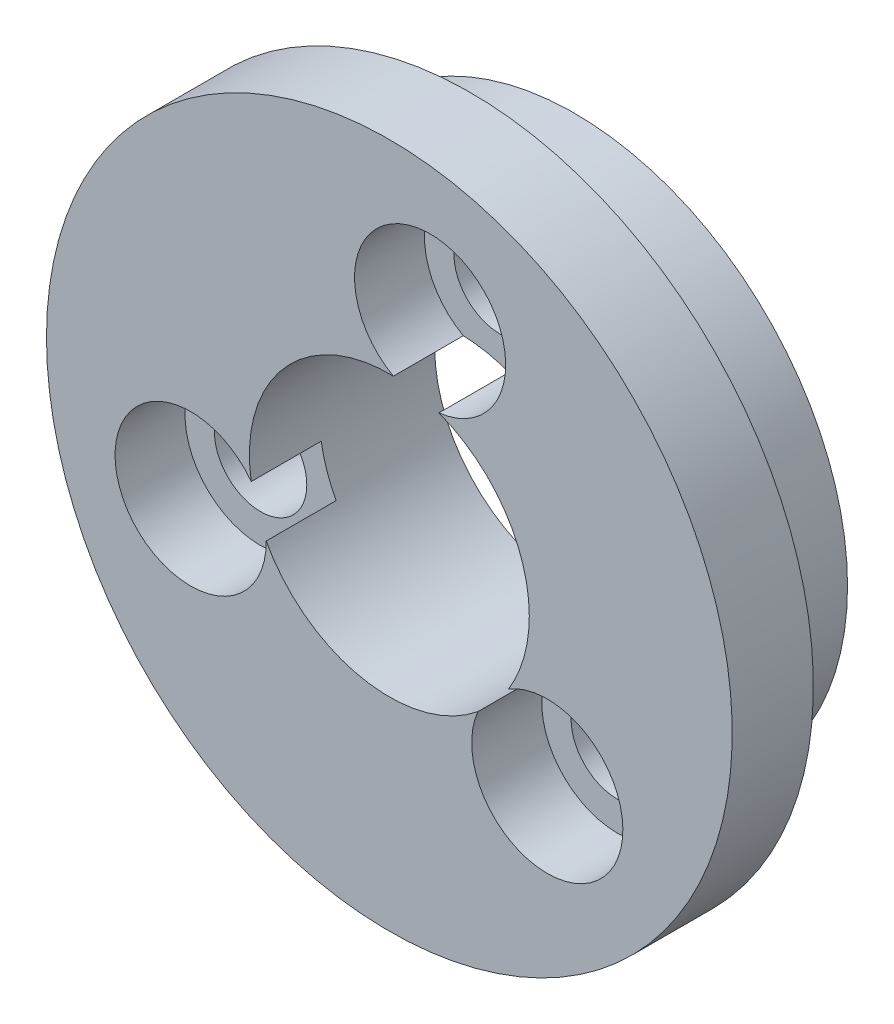
ISO-10303-21;
HEADER;
FILE_DESCRIPTION(('STEP AP214'),'2;1');
FILE_NAME('part.step','',(''),(''),'','','');
FILE_SCHEMA(('AUTOMOTIVE_DESIGN { 1 0 10303 214 1 1 1 1 }'));
ENDSEC;
DATA;
#1=APPLICATION_CONTEXT('core data for automotive mechanical design processes');
#2=APPLICATION_PROTOCOL_DEFINITION('international standard','automotive_design',2000,#1);
#3=PRODUCT_CONTEXT('',#1,'mechanical');
#4=PRODUCT('Part','Part','',(#3));
#5=PRODUCT_RELATED_PRODUCT_CATEGORY('part','',(#4));
#6=PRODUCT_DEFINITION_FORMATION('','',#4);
#7=PRODUCT_DEFINITION_CONTEXT('part definition',#1,'design');
#8=PRODUCT_DEFINITION('design','',#6,#7);
#9=PRODUCT_DEFINITION_SHAPE('','',#8);
#10=(LENGTH_UNIT() NAMED_UNIT(*) SI_UNIT(.MILLI.,.METRE.));
#11=(NAMED_UNIT(*) PLANE_ANGLE_UNIT() SI_UNIT($,.RADIAN.));
#12=(NAMED_UNIT(*) SI_UNIT($,.STERADIAN.) SOLID_ANGLE_UNIT());
#13=UNCERTAINTY_MEASURE_WITH_UNIT(LENGTH_MEASURE(1.E-05),#10,'distance_accuracy_value','');
#14=(GEOMETRIC_REPRESENTATION_CONTEXT(3) GLOBAL_UNCERTAINTY_ASSIGNED_CONTEXT((#13)) GLOBAL_UNIT_ASSIGNED_CONTEXT((#10,
#11,#12)) REPRESENTATION_CONTEXT('',''));
#15=CARTESIAN_POINT('',(0.,0.,0.));
#16=DIRECTION('',(0.,0.,1.));
#17=DIRECTION('',(1.,0.,0.));
#18=AXIS2_PLACEMENT_3D('',#15,#16,#17);
#19=CARTESIAN_POINT('',(351.606527153409,6.98970172283748,-0.00100000000000013));
#20=DIRECTION('',(0.,0.,1.));
#21=DIRECTION('',(1.,0.,0.));
#22=AXIS2_PLACEMENT_3D('',#19,#20,#21);
#23=CYLINDRICAL_SURFACE('',#22,1.64999999999999);
#24=CARTESIAN_POINT('',(351.606527153409,6.98970172283748,-3.72000000003726));
#25=DIRECTION('',(0.,0.,1.));
#26=DIRECTION('',(1.,0.,0.));
#27=AXIS2_PLACEMENT_3D('',#24,#25,#26);
#28=CIRCLE('',#27,1.64999999999999);
#29=CARTESIAN_POINT('',(353.256527153409,6.98970172283748,-3.72000000003726));
#30=VERTEX_POINT('',#29);
#31=EDGE_CURVE('E167',#30,#30,#28,.F.);
#32=ORIENTED_EDGE('',*,*,#31,.T.);
#33=EDGE_LOOP('',(#32));
#34=FACE_BOUND('',#33,.T.);
#35=CARTESIAN_POINT('',(351.606527153409,6.98970172283748,0.399999999963292));
#36=DIRECTION('',(0.,0.,1.));
#37=DIRECTION('',(1.,0.,0.));
#38=AXIS2_PLACEMENT_3D('',#35,#36,#37);
#39=CIRCLE('',#38,1.64999999999999);
#40=CARTESIAN_POINT('',(353.256527153409,6.98970172283748,0.399999999963292));
#41=VERTEX_POINT('',#40);
#42=EDGE_CURVE('E145',#41,#41,#39,.F.);
#43=ORIENTED_EDGE('',*,*,#42,.F.);
#44=EDGE_LOOP('',(#43));
#45=FACE_BOUND('',#44,.T.);
#46=ADVANCED_FACE('F39',(#34,#45),#23,.F.);
#47=CARTESIAN_POINT('',(355.793266576135,-5.30750173999055,-0.00100000000000013));
#48=DIRECTION('',(0.,0.,1.));
#49=DIRECTION('',(1.,0.,0.));
#50=AXIS2_PLACEMENT_3D('',#47,#48,#49);
#51=CYLINDRICAL_SURFACE('',#50,1.64999999999999);
#52=CARTESIAN_POINT('',(355.793266576135,-5.30750173999055,-3.72000000003725));
#53=DIRECTION('',(0.,0.,1.));
#54=DIRECTION('',(1.,0.,0.));
#55=AXIS2_PLACEMENT_3D('',#52,#53,#54);
#56=CIRCLE('',#55,1.64999999999999);
#57=CARTESIAN_POINT('',(357.443266576135,-5.30750173999055,-3.72000000003725));
#58=VERTEX_POINT('',#57);
#59=EDGE_CURVE('E166',#58,#58,#56,.F.);
#60=ORIENTED_EDGE('',*,*,#59,.T.);
#61=EDGE_LOOP('',(#60));
#62=FACE_BOUND('',#61,.T.);
#63=CARTESIAN_POINT('',(355.793266576135,-5.30750173999055,0.399999999963292));
#64=DIRECTION('',(0.,0.,1.));
#65=DIRECTION('',(1.,0.,0.));
#66=AXIS2_PLACEMENT_3D('',#63,#64,#65);
#67=CIRCLE('',#66,1.64999999999999);
#68=CARTESIAN_POINT('',(357.443266576135,-5.30750173999055,0.399999999963292));
#69=VERTEX_POINT('',#68);
#70=EDGE_CURVE('E141',#69,#69,#67,.F.);
#71=ORIENTED_EDGE('',*,*,#70,.F.);
#72=EDGE_LOOP('',(#71));
#73=FACE_BOUND('',#72,.T.);
#74=ADVANCED_FACE('F196',(#62,#73),#51,.F.);
#75=CARTESIAN_POINT('',(343.050206270457,-2.78472270768337,-0.00100000000000013));
#76=DIRECTION('',(0.,0.,1.));
#77=DIRECTION('',(1.,0.,0.));
#78=AXIS2_PLACEMENT_3D('',#75,#76,#77);
#79=CYLINDRICAL_SURFACE('',#78,1.64999999999999);
#80=CARTESIAN_POINT('',(343.050206270457,-2.78472270768337,-3.72000000003724));
#81=DIRECTION('',(0.,0.,1.));
#82=DIRECTION('',(1.,0.,0.));
#83=AXIS2_PLACEMENT_3D('',#80,#81,#82);
#84=CIRCLE('',#83,1.64999999999999);
#85=CARTESIAN_POINT('',(344.700206270457,-2.78472270768337,-3.72000000003724));
#86=VERTEX_POINT('',#85);
#87=EDGE_CURVE('E171',#86,#86,#84,.F.);
#88=ORIENTED_EDGE('',*,*,#87,.T.);
#89=EDGE_LOOP('',(#88));
#90=FACE_BOUND('',#89,.T.);
#91=CARTESIAN_POINT('',(343.050206270457,-2.78472270768337,0.399999999963292));
#92=DIRECTION('',(0.,0.,1.));
#93=DIRECTION('',(1.,0.,0.));
#94=AXIS2_PLACEMENT_3D('',#91,#92,#93);
#95=CIRCLE('',#94,1.64999999999999);
#96=CARTESIAN_POINT('',(344.700206270457,-2.78472270768337,0.399999999963292));
#97=VERTEX_POINT('',#96);
#98=EDGE_CURVE('E138',#97,#97,#95,.F.);
#99=ORIENTED_EDGE('',*,*,#98,.F.);
#100=EDGE_LOOP('',(#99));
#101=FACE_BOUND('',#100,.T.);
#102=ADVANCED_FACE('F202',(#90,#101),#79,.F.);
#103=CARTESIAN_POINT('',(350.15,-0.367507574945491,0.));
#104=DIRECTION('',(0.,0.,1.));
#105=DIRECTION('',(1.,0.,0.));
#106=AXIS2_PLACEMENT_3D('',#103,#104,#105);
#107=PLANE('',#106);
#108=CARTESIAN_POINT('',(350.15,-0.367507574945491,0.));
#109=DIRECTION('',(0.,0.,1.));
#110=DIRECTION('',(1.,0.,0.));
#111=AXIS2_PLACEMENT_3D('',#108,#109,#110);
#112=CIRCLE('',#111,12.25);
#113=CARTESIAN_POINT('',(337.900000000001,-0.367507574945491,0.));
#114=VERTEX_POINT('',#113);
#115=EDGE_CURVE('E124',#114,#114,#112,.T.);
#116=ORIENTED_EDGE('',*,*,#115,.F.);
#117=EDGE_LOOP('',(#116));
#118=FACE_BOUND('',#117,.T.);
#119=CARTESIAN_POINT('',(350.15,-0.367507574945587,0.));
#120=DIRECTION('',(0.,0.,1.));
#121=DIRECTION('',(1.,0.,0.));
#122=AXIS2_PLACEMENT_3D('',#119,#120,#121);
#123=CIRCLE('',#122,9.74999999999997);
#124=CARTESIAN_POINT('',(359.9,-0.367507574945587,0.));
#125=VERTEX_POINT('',#124);
#126=EDGE_CURVE('E135',#125,#125,#123,.F.);
#127=ORIENTED_EDGE('',*,*,#126,.F.);
#128=EDGE_LOOP('',(#127));
#129=FACE_BOUND('',#128,.T.);
#130=ADVANCED_FACE('F209',(#118,#129),#107,.F.);
#131=CARTESIAN_POINT('',(350.15,-0.367507574945491,37.5482322781036));
#132=DIRECTION('',(0.,0.,-1.));
#133=DIRECTION('',(-1.,0.,0.));
#134=AXIS2_PLACEMENT_3D('',#131,#132,#133);
#135=CYLINDRICAL_SURFACE('',#134,12.25);
#136=CARTESIAN_POINT('',(350.15,-0.367507574945491,2.89999999996277));
#137=DIRECTION('',(0.,0.,1.));
#138=DIRECTION('',(1.,0.,0.));
#139=AXIS2_PLACEMENT_3D('',#136,#137,#138);
#140=CIRCLE('',#139,12.25);
#141=CARTESIAN_POINT('',(337.900000000001,-0.367507574945491,2.89999999996279));
#142=VERTEX_POINT('',#141);
#143=EDGE_CURVE('E132',#142,#142,#140,.T.);
#144=CARTESIAN_POINT('',(337.900000000001,-0.367507574945491,0.));
#145=CARTESIAN_POINT('',(337.900000000001,-0.367507574945491,0.0302083333329391));
#146=CARTESIAN_POINT('',(337.900000000001,-0.367507574945491,0.0604166666658852));
#147=CARTESIAN_POINT('',(337.900000000001,-0.367507574945491,0.120833333331777));
#148=CARTESIAN_POINT('',(337.900000000001,-0.367507574945491,0.151041666664723));
#149=CARTESIAN_POINT('',(337.900000000001,-0.367507574945491,0.211458333330615));
#150=CARTESIAN_POINT('',(337.900000000001,-0.367507574945491,0.241666666663561));
#151=CARTESIAN_POINT('',(337.900000000001,-0.367507574945491,0.302083333329454));
#152=CARTESIAN_POINT('',(337.900000000001,-0.367507574945491,0.3322916666624));
#153=CARTESIAN_POINT('',(337.900000000001,-0.367507574945491,0.392708333328289));
#154=CARTESIAN_POINT('',(337.900000000001,-0.367507574945491,0.422916666661233));
#155=CARTESIAN_POINT('',(337.900000000001,-0.367507574945491,0.483333333327123));
#156=CARTESIAN_POINT('',(337.900000000001,-0.367507574945491,0.513541666660069));
#157=CARTESIAN_POINT('',(337.900000000001,-0.367507574945491,0.573958333325961));
#158=CARTESIAN_POINT('',(337.900000000001,-0.367507574945491,0.604166666658907));
#159=CARTESIAN_POINT('',(337.900000000001,-0.367507574945491,0.664583333324799));
#160=CARTESIAN_POINT('',(337.900000000001,-0.367507574945491,0.694791666657745));
#161=CARTESIAN_POINT('',(337.900000000001,-0.367507574945491,0.755208333323637));
#162=CARTESIAN_POINT('',(337.900000000001,-0.367507574945491,0.785416666656583));
#163=CARTESIAN_POINT('',(337.900000000001,-0.367507574945491,0.845833333322476));
#164=CARTESIAN_POINT('',(337.900000000001,-0.367507574945491,0.876041666655422));
#165=CARTESIAN_POINT('',(337.900000000001,-0.367507574945491,0.936458333321314));
#166=CARTESIAN_POINT('',(337.900000000001,-0.367507574945491,0.96666666665426));
#167=CARTESIAN_POINT('',(337.900000000001,-0.367507574945491,1.02708333332015));
#168=CARTESIAN_POINT('',(337.900000000001,-0.367507574945491,1.05729166665309));
#169=CARTESIAN_POINT('',(337.900000000001,-0.367507574945491,1.11770833331898));
#170=CARTESIAN_POINT('',(337.900000000001,-0.367507574945491,1.14791666665193));
#171=CARTESIAN_POINT('',(337.900000000001,-0.367507574945491,1.20833333331782));
#172=CARTESIAN_POINT('',(337.900000000001,-0.367507574945491,1.23854166665077));
#173=CARTESIAN_POINT('',(337.900000000001,-0.367507574945491,1.29895833331666));
#174=CARTESIAN_POINT('',(337.900000000001,-0.367507574945491,1.32916666664961));
#175=CARTESIAN_POINT('',(337.900000000001,-0.367507574945491,1.3895833333155));
#176=CARTESIAN_POINT('',(337.900000000001,-0.367507574945491,1.41979166664844));
#177=CARTESIAN_POINT('',(337.900000000001,-0.367507574945491,1.48020833331434));
#178=CARTESIAN_POINT('',(337.900000000001,-0.367507574945491,1.51041666664728));
#179=CARTESIAN_POINT('',(337.900000000001,-0.367507574945491,1.57083333331317));
#180=CARTESIAN_POINT('',(337.900000000001,-0.367507574945491,1.60104166664612));
#181=CARTESIAN_POINT('',(337.900000000001,-0.367507574945491,1.66145833331201));
#182=CARTESIAN_POINT('',(337.900000000001,-0.367507574945491,1.69166666664496));
#183=CARTESIAN_POINT('',(337.900000000001,-0.367507574945491,1.75208333331085));
#184=CARTESIAN_POINT('',(337.900000000001,-0.367507574945491,1.7822916666438));
#185=CARTESIAN_POINT('',(337.900000000001,-0.367507574945491,1.84270833330969));
#186=CARTESIAN_POINT('',(337.900000000001,-0.367507574945491,1.87291666664263));
#187=CARTESIAN_POINT('',(337.900000000001,-0.367507574945491,1.93333333330852));
#188=CARTESIAN_POINT('',(337.900000000001,-0.367507574945491,1.96354166664147));
#189=CARTESIAN_POINT('',(337.900000000001,-0.367507574945491,2.02395833330736));
#190=CARTESIAN_POINT('',(337.900000000001,-0.367507574945491,2.0541666666403));
#191=CARTESIAN_POINT('',(337.900000000001,-0.367507574945491,2.1145833333062));
#192=CARTESIAN_POINT('',(337.900000000001,-0.367507574945491,2.14479166663914));
#193=CARTESIAN_POINT('',(337.900000000001,-0.367507574945491,2.20520833330503));
#194=CARTESIAN_POINT('',(337.900000000001,-0.367507574945491,2.23541666663798));
#195=CARTESIAN_POINT('',(337.900000000001,-0.367507574945491,2.29583333330387));
#196=CARTESIAN_POINT('',(337.900000000001,-0.367507574945491,2.32604166663682));
#197=CARTESIAN_POINT('',(337.900000000001,-0.367507574945491,2.38645833330271));
#198=CARTESIAN_POINT('',(337.900000000001,-0.367507574945491,2.41666666663566));
#199=CARTESIAN_POINT('',(337.900000000001,-0.367507574945491,2.47708333330155));
#200=CARTESIAN_POINT('',(337.900000000001,-0.367507574945491,2.50729166663449));
#201=CARTESIAN_POINT('',(337.900000000001,-0.367507574945491,2.56770833330038));
#202=CARTESIAN_POINT('',(337.900000000001,-0.367507574945491,2.59791666663333));
#203=CARTESIAN_POINT('',(337.900000000001,-0.367507574945491,2.65833333329922));
#204=CARTESIAN_POINT('',(337.900000000001,-0.367507574945491,2.68854166663216));
#205=CARTESIAN_POINT('',(337.900000000001,-0.367507574945491,2.74895833329806));
#206=CARTESIAN_POINT('',(337.900000000001,-0.367507574945491,2.779166666631));
#207=CARTESIAN_POINT('',(337.900000000001,-0.367507574945491,2.83958333329689));
#208=CARTESIAN_POINT('',(337.900000000001,-0.367507574945491,2.86979166662984));
#209=CARTESIAN_POINT('',(337.900000000001,-0.367507574945491,2.89999999996279));
#210=B_SPLINE_CURVE_WITH_KNOTS('',3,(#144,#145,#146,#147,#148,#149,#150,#151,#152,#153,#154,
#155,#156,#157,#158,#159,#160,#161,#162,#163,#164,#165,#166,#167,#168,#169,#170,#171,#172,#173,
#174,#175,#176,#177,#178,#179,#180,#181,#182,#183,#184,#185,#186,#187,#188,#189,#190,#191,#192,
#193,#194,#195,#196,#197,#198,#199,#200,#201,#202,#203,#204,#205,#206,#207,#208,#209),
.UNSPECIFIED.,.F.,.F.,(4,2,2,2,2,2,2,2,2,2,2,2,2,2,2,2,2,2,2,2,2,2,2,2,2,2,2,2,2,2,2,2,4),(0.,
0.0906249999988382,0.181249999997676,0.271874999996514,0.362499999995353,0.453124999994184,
0.543749999993022,0.63437499999186,0.724999999990698,0.815624999989537,0.906249999988375,
0.996874999987213,1.08749999998604,1.17812499998488,1.26874999998372,1.35937499998256,
1.4499999999814,1.54062499998023,1.63124999997907,1.72187499997791,1.81249999997675,
1.90312499997558,1.99374999997442,2.08437499997326,2.1749999999721,2.26562499997093,
2.35624999996977,2.44687499996861,2.53749999996744,2.62812499996628,2.71874999996512,
2.80937499996396,2.89999999996279),.UNSPECIFIED.);
#211=EDGE_CURVE('BSEAM192',#114,#142,#210,.T.);
#212=ORIENTED_EDGE('',*,*,#115,.T.);
#213=ORIENTED_EDGE('',*,*,#143,.F.);
#214=ORIENTED_EDGE('',*,*,#211,.T.);
#215=ORIENTED_EDGE('',*,*,#211,.F.);
#216=EDGE_LOOP('',(#212,#214,#213,#215));
#217=FACE_BOUND('',#216,.T.);
#218=ADVANCED_FACE('F192',(#217),#135,.T.);
#219=CARTESIAN_POINT('',(53.7605178941677,-19.4010279281596,2.8999999999632));
#220=DIRECTION('',(0.,0.,1.));
#221=DIRECTION('',(0.997944384194723,0.0640859271151991,0.));
#222=AXIS2_PLACEMENT_3D('',#219,#220,#221);
#223=PLANE('',#222);
#224=CARTESIAN_POINT('',(351.606527153409,6.98970172283748,2.89999999996329));
#225=DIRECTION('',(0.,0.,1.));
#226=DIRECTION('',(1.,0.,0.));
#227=AXIS2_PLACEMENT_3D('',#224,#225,#226);
#228=CIRCLE('',#227,2.69999999999996);
#229=CARTESIAN_POINT('',(351.921530236478,4.30814004022473,2.89999999996329));
#230=VERTEX_POINT('',#229);
#231=CARTESIAN_POINT('',(350.293576399365,4.63043058168926,2.89999999996329));
#232=VERTEX_POINT('',#231);
#233=EDGE_CURVE('E156',#230,#232,#228,.T.);
#234=ORIENTED_EDGE('',*,*,#233,.F.);
#235=CARTESIAN_POINT('',(350.15,-0.367507574945493,2.89999999996329));
#236=DIRECTION('',(0.,0.,1.));
#237=DIRECTION('',(1.,0.,0.));
#238=AXIS2_PLACEMENT_3D('',#235,#236,#237);
#239=CIRCLE('',#238,4.99999999999999);
#240=CARTESIAN_POINT('',(354.406553210508,-2.99081746249628,2.89999999996329));
#241=VERTEX_POINT('',#240);
#242=EDGE_CURVE('E122',#241,#230,#239,.T.);
#243=ORIENTED_EDGE('',*,*,#242,.F.);
#244=CARTESIAN_POINT('',(355.793266576135,-5.30750173999055,2.89999999996329));
#245=DIRECTION('',(0.,0.,1.));
#246=DIRECTION('',(1.,0.,0.));
#247=AXIS2_PLACEMENT_3D('',#244,#245,#246);
#248=CIRCLE('',#247,2.69999999999996);
#249=CARTESIAN_POINT('',(353.313464495643,-4.23952157089217,2.89999999996329));
#250=VERTEX_POINT('',#249);
#251=EDGE_CURVE('E120',#250,#241,#248,.T.);
#252=ORIENTED_EDGE('',*,*,#251,.F.);
#253=CARTESIAN_POINT('',(345.749870390129,-2.74213584402943,2.89999999996329));
#254=VERTEX_POINT('',#253);
#255=EDGE_CURVE('E112',#254,#250,#239,.T.);
#256=ORIENTED_EDGE('',*,*,#255,.F.);
#257=CARTESIAN_POINT('',(343.050206270457,-2.78472270768337,2.89999999996329));
#258=DIRECTION('',(0.,0.,1.));
#259=DIRECTION('',(1.,0.,0.));
#260=AXIS2_PLACEMENT_3D('',#257,#258,#259);
#261=CIRCLE('',#260,2.69999999999996);
#262=CARTESIAN_POINT('',(345.21500526788,-1.17114119416899,2.89999999996329));
#263=VERTEX_POINT('',#262);
#264=EDGE_CURVE('E92',#263,#254,#261,.T.);
#265=ORIENTED_EDGE('',*,*,#264,.F.);
#266=EDGE_CURVE('E121',#232,#263,#239,.T.);
#267=ORIENTED_EDGE('',*,*,#266,.F.);
#268=EDGE_LOOP('',(#234,#243,#252,#256,#265,#267));
#269=FACE_BOUND('',#268,.T.);
#270=ORIENTED_EDGE('',*,*,#143,.T.);
#271=EDGE_LOOP('',(#270));
#272=FACE_BOUND('',#271,.T.);
#273=ADVANCED_FACE('F41',(#269,#272),#223,.T.);
#274=CARTESIAN_POINT('',(350.15,-0.367507574945493,-0.00100000000000013));
#275=DIRECTION('',(0.,0.,1.));
#276=DIRECTION('',(1.,0.,0.));
#277=AXIS2_PLACEMENT_3D('',#274,#275,#276);
#278=CYLINDRICAL_SURFACE('',#277,4.99999999999999);
#279=CARTESIAN_POINT('',(350.15,-0.367507574945493,0.399999999963292));
#280=DIRECTION('',(0.,0.,1.));
#281=DIRECTION('',(1.,0.,0.));
#282=AXIS2_PLACEMENT_3D('',#279,#280,#281);
#283=CIRCLE('',#282,4.99999999999999);
#284=CARTESIAN_POINT('',(350.293576399365,4.63043058168926,0.399999999963292));
#285=VERTEX_POINT('',#284);
#286=CARTESIAN_POINT('',(351.921530236478,4.30814004022473,0.399999999963292));
#287=VERTEX_POINT('',#286);
#288=EDGE_CURVE('E148',#285,#287,#283,.F.);
#289=ORIENTED_EDGE('',*,*,#288,.F.);
#290=DIRECTION('',(0.,0.,1.));
#291=VECTOR('',#290,1.);
#292=CARTESIAN_POINT('',(350.293576399365,4.63043058168926,1.64999999996329));
#293=LINE('',#292,#291);
#294=EDGE_CURVE('E11',#285,#232,#293,.T.);
#295=ORIENTED_EDGE('',*,*,#294,.T.);
#296=ORIENTED_EDGE('',*,*,#266,.T.);
#297=DIRECTION('',(0.,0.,1.));
#298=VECTOR('',#297,1.);
#299=CARTESIAN_POINT('',(345.21500526788,-1.17114119416898,1.64999999996329));
#300=LINE('',#299,#298);
#301=CARTESIAN_POINT('',(345.21500526788,-1.17114119416899,0.399999999963292));
#302=VERTEX_POINT('',#301);
#303=EDGE_CURVE('E99',#263,#302,#300,.F.);
#304=ORIENTED_EDGE('',*,*,#303,.T.);
#305=CARTESIAN_POINT('',(350.15,-0.367507574945493,0.399999999963292));
#306=DIRECTION('',(0.,0.,1.));
#307=DIRECTION('',(1.,0.,0.));
#308=AXIS2_PLACEMENT_3D('',#305,#306,#307);
#309=CIRCLE('',#308,4.99999999999999);
#310=CARTESIAN_POINT('',(345.749870390129,-2.74213584402943,0.399999999963292));
#311=VERTEX_POINT('',#310);
#312=EDGE_CURVE('E113',#311,#302,#309,.F.);
#313=ORIENTED_EDGE('',*,*,#312,.F.);
#314=DIRECTION('',(0.,0.,1.));
#315=VECTOR('',#314,1.);
#316=CARTESIAN_POINT('',(345.749870390129,-2.74213584402945,1.64999999996329));
#317=LINE('',#316,#315);
#318=EDGE_CURVE('E96',#311,#254,#317,.T.);
#319=ORIENTED_EDGE('',*,*,#318,.T.);
#320=ORIENTED_EDGE('',*,*,#255,.T.);
#321=DIRECTION('',(0.,0.,1.));
#322=VECTOR('',#321,1.);
#323=CARTESIAN_POINT('',(353.313464495643,-4.23952157089217,1.64999999996329));
#324=LINE('',#323,#322);
#325=CARTESIAN_POINT('',(353.313464495643,-4.23952157089217,0.399999999963292));
#326=VERTEX_POINT('',#325);
#327=EDGE_CURVE('E114',#250,#326,#324,.F.);
#328=ORIENTED_EDGE('',*,*,#327,.T.);
#329=CARTESIAN_POINT('',(350.15,-0.367507574945493,0.399999999963292));
#330=DIRECTION('',(0.,0.,1.));
#331=DIRECTION('',(1.,0.,0.));
#332=AXIS2_PLACEMENT_3D('',#329,#330,#331);
#333=CIRCLE('',#332,4.99999999999999);
#334=CARTESIAN_POINT('',(354.406553210508,-2.99081746249628,0.399999999963292));
#335=VERTEX_POINT('',#334);
#336=EDGE_CURVE('E144',#335,#326,#333,.F.);
#337=ORIENTED_EDGE('',*,*,#336,.F.);
#338=DIRECTION('',(0.,0.,1.));
#339=VECTOR('',#338,1.);
#340=CARTESIAN_POINT('',(354.406553210508,-2.99081746249628,1.64999999996329));
#341=LINE('',#340,#339);
#342=EDGE_CURVE('E151',#335,#241,#341,.T.);
#343=ORIENTED_EDGE('',*,*,#342,.T.);
#344=ORIENTED_EDGE('',*,*,#242,.T.);
#345=DIRECTION('',(0.,0.,1.));
#346=VECTOR('',#345,1.);
#347=CARTESIAN_POINT('',(351.921530236478,4.30814004022473,1.64999999996329));
#348=LINE('',#347,#346);
#349=EDGE_CURVE('E47',#230,#287,#348,.F.);
#350=ORIENTED_EDGE('',*,*,#349,.T.);
#351=EDGE_LOOP('',(#289,#295,#296,#304,#313,#319,#320,#328,#337,#343,#344,#350));
#352=FACE_BOUND('',#351,.T.);
#353=CARTESIAN_POINT('',(350.15,-0.367507574945587,-3.72000000003725));
#354=DIRECTION('',(0.,0.,1.));
#355=DIRECTION('',(1.,0.,0.));
#356=AXIS2_PLACEMENT_3D('',#353,#354,#355);
#357=CIRCLE('',#356,4.99999999999981);
#358=CARTESIAN_POINT('',(355.15,-0.367507574945587,-3.72000000003726));
#359=VERTEX_POINT('',#358);
#360=EDGE_CURVE('E126',#359,#359,#357,.T.);
#361=ORIENTED_EDGE('',*,*,#360,.F.);
#362=EDGE_LOOP('',(#361));
#363=FACE_BOUND('',#362,.T.);
#364=ADVANCED_FACE('F109',(#352,#363),#278,.F.);
#365=CARTESIAN_POINT('',(350.15,-0.367507574945587,-31.2971644663125));
#366=DIRECTION('',(0.,0.,1.));
#367=DIRECTION('',(1.,0.,0.));
#368=AXIS2_PLACEMENT_3D('',#365,#366,#367);
#369=CYLINDRICAL_SURFACE('',#368,9.74999999999997);
#370=CARTESIAN_POINT('',(350.15,-0.367507574945587,-3.72000000003725));
#371=DIRECTION('',(0.,0.,1.));
#372=DIRECTION('',(1.,0.,0.));
#373=AXIS2_PLACEMENT_3D('',#370,#371,#372);
#374=CIRCLE('',#373,9.74999999999997);
#375=CARTESIAN_POINT('',(359.9,-0.367507574945587,-3.72000000003726));
#376=VERTEX_POINT('',#375);
#377=EDGE_CURVE('E170',#376,#376,#374,.T.);
#378=ORIENTED_EDGE('',*,*,#377,.T.);
#379=EDGE_LOOP('',(#378));
#380=FACE_BOUND('',#379,.T.);
#381=ORIENTED_EDGE('',*,*,#126,.T.);
#382=EDGE_LOOP('',(#381));
#383=FACE_BOUND('',#382,.T.);
#384=ADVANCED_FACE('F184',(#380,#383),#369,.T.);
#385=CARTESIAN_POINT('',(350.150000000001,-0.367507574945483,-3.72000000003725));
#386=DIRECTION('',(0.,0.,1.));
#387=DIRECTION('',(0.997944384194723,0.064085927115199,0.));
#388=AXIS2_PLACEMENT_3D('',#385,#386,#387);
#389=PLANE('',#388);
#390=ORIENTED_EDGE('',*,*,#31,.F.);
#391=EDGE_LOOP('',(#390));
#392=FACE_BOUND('',#391,.T.);
#393=ORIENTED_EDGE('',*,*,#87,.F.);
#394=EDGE_LOOP('',(#393));
#395=FACE_BOUND('',#394,.T.);
#396=ORIENTED_EDGE('',*,*,#59,.F.);
#397=EDGE_LOOP('',(#396));
#398=FACE_BOUND('',#397,.T.);
#399=ORIENTED_EDGE('',*,*,#360,.T.);
#400=EDGE_LOOP('',(#399));
#401=FACE_BOUND('',#400,.T.);
#402=ORIENTED_EDGE('',*,*,#377,.F.);
#403=EDGE_LOOP('',(#402));
#404=FACE_BOUND('',#403,.T.);
#405=ADVANCED_FACE('F181',(#392,#395,#398,#401,#404),#389,.F.);
#406=CARTESIAN_POINT('',(343.050206270457,-2.78472270768337,0.399999999963292));
#407=DIRECTION('',(0.,0.,1.));
#408=DIRECTION('',(1.,0.,0.));
#409=AXIS2_PLACEMENT_3D('',#406,#407,#408);
#410=CYLINDRICAL_SURFACE('',#409,2.69999999999996);
#411=CARTESIAN_POINT('',(343.050206270457,-2.78472270768337,0.399999999963292));
#412=DIRECTION('',(0.,0.,1.));
#413=DIRECTION('',(1.,0.,0.));
#414=AXIS2_PLACEMENT_3D('',#411,#412,#413);
#415=CIRCLE('',#414,2.69999999999996);
#416=EDGE_CURVE('E104',#302,#311,#415,.T.);
#417=ORIENTED_EDGE('',*,*,#416,.F.);
#418=ORIENTED_EDGE('',*,*,#303,.F.);
#419=ORIENTED_EDGE('',*,*,#264,.T.);
#420=ORIENTED_EDGE('',*,*,#318,.F.);
#421=EDGE_LOOP('',(#417,#418,#419,#420));
#422=FACE_BOUND('',#421,.T.);
#423=ADVANCED_FACE('F95',(#422),#410,.F.);
#424=CARTESIAN_POINT('',(343.050206270457,-2.78472270768337,0.399999999963292));
#425=DIRECTION('',(0.,0.,1.));
#426=DIRECTION('',(1.,0.,0.));
#427=AXIS2_PLACEMENT_3D('',#424,#425,#426);
#428=PLANE('',#427);
#429=ORIENTED_EDGE('',*,*,#98,.T.);
#430=EDGE_LOOP('',(#429));
#431=FACE_BOUND('',#430,.T.);
#432=ORIENTED_EDGE('',*,*,#312,.T.);
#433=ORIENTED_EDGE('',*,*,#416,.T.);
#434=EDGE_LOOP('',(#432,#433));
#435=FACE_BOUND('',#434,.T.);
#436=ADVANCED_FACE('F213',(#431,#435),#428,.T.);
#437=CARTESIAN_POINT('',(355.793266576135,-5.30750173999055,0.399999999963292));
#438=DIRECTION('',(0.,0.,1.));
#439=DIRECTION('',(1.,0.,0.));
#440=AXIS2_PLACEMENT_3D('',#437,#438,#439);
#441=CYLINDRICAL_SURFACE('',#440,2.69999999999996);
#442=CARTESIAN_POINT('',(355.793266576135,-5.30750173999055,0.399999999963292));
#443=DIRECTION('',(0.,0.,1.));
#444=DIRECTION('',(1.,0.,0.));
#445=AXIS2_PLACEMENT_3D('',#442,#443,#444);
#446=CIRCLE('',#445,2.69999999999996);
#447=EDGE_CURVE('E60',#326,#335,#446,.T.);
#448=ORIENTED_EDGE('',*,*,#447,.F.);
#449=ORIENTED_EDGE('',*,*,#327,.F.);
#450=ORIENTED_EDGE('',*,*,#251,.T.);
#451=ORIENTED_EDGE('',*,*,#342,.F.);
#452=EDGE_LOOP('',(#448,#449,#450,#451));
#453=FACE_BOUND('',#452,.T.);
#454=ADVANCED_FACE('F216',(#453),#441,.F.);
#455=CARTESIAN_POINT('',(355.793266576135,-5.30750173999055,0.399999999963292));
#456=DIRECTION('',(0.,0.,1.));
#457=DIRECTION('',(1.,0.,0.));
#458=AXIS2_PLACEMENT_3D('',#455,#456,#457);
#459=PLANE('',#458);
#460=ORIENTED_EDGE('',*,*,#70,.T.);
#461=EDGE_LOOP('',(#460));
#462=FACE_BOUND('',#461,.T.);
#463=ORIENTED_EDGE('',*,*,#336,.T.);
#464=ORIENTED_EDGE('',*,*,#447,.T.);
#465=EDGE_LOOP('',(#463,#464));
#466=FACE_BOUND('',#465,.T.);
#467=ADVANCED_FACE('F219',(#462,#466),#459,.T.);
#468=CARTESIAN_POINT('',(351.606527153409,6.98970172283748,0.399999999963292));
#469=DIRECTION('',(0.,0.,1.));
#470=DIRECTION('',(1.,0.,0.));
#471=AXIS2_PLACEMENT_3D('',#468,#469,#470);
#472=CYLINDRICAL_SURFACE('',#471,2.69999999999996);
#473=CARTESIAN_POINT('',(351.606527153409,6.98970172283748,0.399999999963292));
#474=DIRECTION('',(0.,0.,1.));
#475=DIRECTION('',(1.,0.,0.));
#476=AXIS2_PLACEMENT_3D('',#473,#474,#475);
#477=CIRCLE('',#476,2.69999999999996);
#478=EDGE_CURVE('E53',#287,#285,#477,.T.);
#479=ORIENTED_EDGE('',*,*,#478,.F.);
#480=ORIENTED_EDGE('',*,*,#349,.F.);
#481=ORIENTED_EDGE('',*,*,#233,.T.);
#482=ORIENTED_EDGE('',*,*,#294,.F.);
#483=EDGE_LOOP('',(#479,#480,#481,#482));
#484=FACE_BOUND('',#483,.T.);
#485=ADVANCED_FACE('F155',(#484),#472,.F.);
#486=CARTESIAN_POINT('',(351.606527153409,6.98970172283748,0.399999999963292));
#487=DIRECTION('',(0.,0.,1.));
#488=DIRECTION('',(1.,0.,0.));
#489=AXIS2_PLACEMENT_3D('',#486,#487,#488);
#490=PLANE('',#489);
#491=ORIENTED_EDGE('',*,*,#42,.T.);
#492=EDGE_LOOP('',(#491));
#493=FACE_BOUND('',#492,.T.);
#494=ORIENTED_EDGE('',*,*,#288,.T.);
#495=ORIENTED_EDGE('',*,*,#478,.T.);
#496=EDGE_LOOP('',(#494,#495));
#497=FACE_BOUND('',#496,.T.);
#498=ADVANCED_FACE('F228',(#493,#497),#490,.T.);
#499=CLOSED_SHELL('',(#46,#74,#102,#130,#218,#273,#364,#384,#405,#423,#436,#454,#467,#485,#498));
#500=MANIFOLD_SOLID_BREP('B2',#499);
#501=ADVANCED_BREP_SHAPE_REPRESENTATION('',(#18,#500),#14);
#502=SHAPE_DEFINITION_REPRESENTATION(#9,#501);
ENDSEC;
END-ISO-10303-21;
